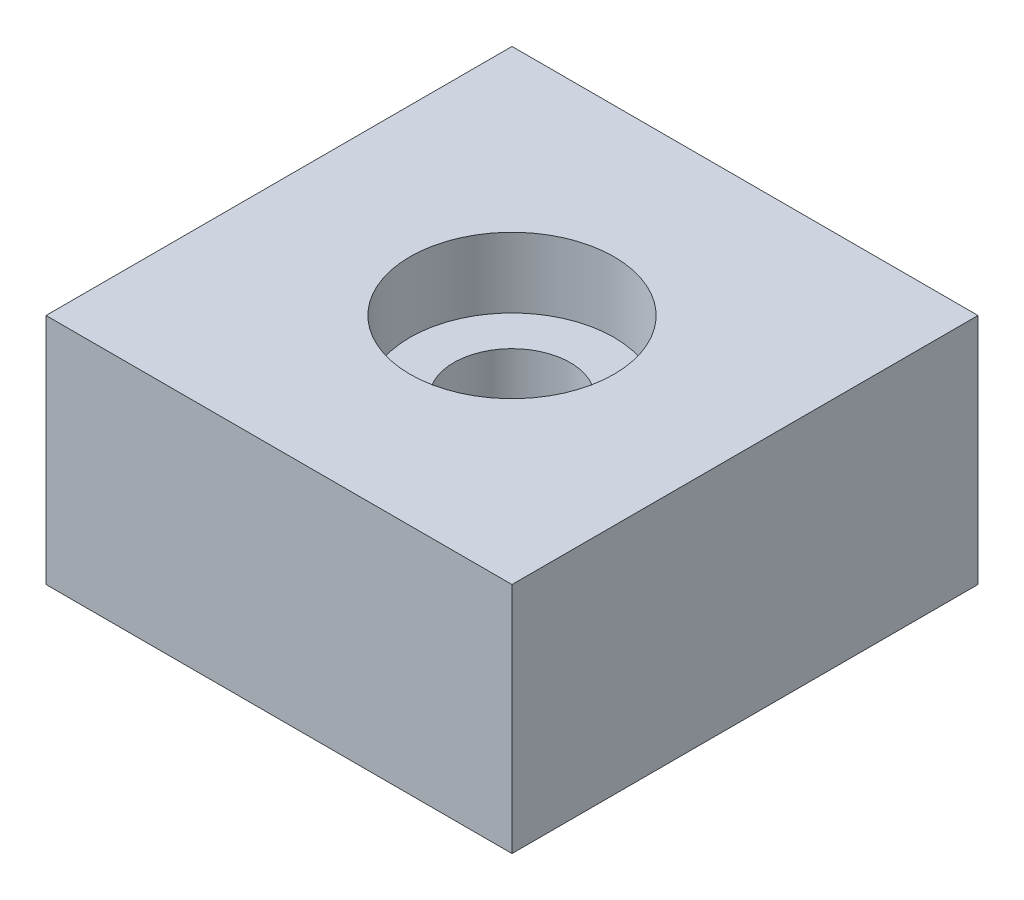
ISO-10303-21;
HEADER;
FILE_DESCRIPTION(('STEP AP214'),'2;1');
FILE_NAME('part.step','',(''),(''),'','','');
FILE_SCHEMA(('AUTOMOTIVE_DESIGN { 1 0 10303 214 1 1 1 1 }'));
ENDSEC;
DATA;
#1=APPLICATION_CONTEXT('core data for automotive mechanical design processes');
#2=APPLICATION_PROTOCOL_DEFINITION('international standard','automotive_design',2000,#1);
#3=PRODUCT_CONTEXT('',#1,'mechanical');
#4=PRODUCT('Part','Part','',(#3));
#5=PRODUCT_RELATED_PRODUCT_CATEGORY('part','',(#4));
#6=PRODUCT_DEFINITION_FORMATION('','',#4);
#7=PRODUCT_DEFINITION_CONTEXT('part definition',#1,'design');
#8=PRODUCT_DEFINITION('design','',#6,#7);
#9=PRODUCT_DEFINITION_SHAPE('','',#8);
#10=(LENGTH_UNIT() NAMED_UNIT(*) SI_UNIT(.MILLI.,.METRE.));
#11=(NAMED_UNIT(*) PLANE_ANGLE_UNIT() SI_UNIT($,.RADIAN.));
#12=(NAMED_UNIT(*) SI_UNIT($,.STERADIAN.) SOLID_ANGLE_UNIT());
#13=UNCERTAINTY_MEASURE_WITH_UNIT(LENGTH_MEASURE(1.E-05),#10,'distance_accuracy_value','');
#14=(GEOMETRIC_REPRESENTATION_CONTEXT(3) GLOBAL_UNCERTAINTY_ASSIGNED_CONTEXT((#13)) GLOBAL_UNIT_ASSIGNED_CONTEXT((#10,
#11,#12)) REPRESENTATION_CONTEXT('',''));
#15=CARTESIAN_POINT('',(0.,0.,0.));
#16=DIRECTION('',(0.,0.,1.));
#17=DIRECTION('',(1.,0.,0.));
#18=AXIS2_PLACEMENT_3D('',#15,#16,#17);
#19=CARTESIAN_POINT('',(25.4,25.4,25.4));
#20=DIRECTION('',(-1.,0.,0.));
#21=DIRECTION('',(0.,0.,1.));
#22=AXIS2_PLACEMENT_3D('',#19,#20,#21);
#23=PLANE('',#22);
#24=DIRECTION('',(0.,0.,-1.));
#25=VECTOR('',#24,1.);
#26=CARTESIAN_POINT('',(25.4,0.,25.4));
#27=LINE('',#26,#25);
#28=CARTESIAN_POINT('',(25.4,0.,25.4));
#29=VERTEX_POINT('',#28);
#30=CARTESIAN_POINT('',(25.4,0.,-25.4));
#31=VERTEX_POINT('',#30);
#32=EDGE_CURVE('E97',#29,#31,#27,.T.);
#33=ORIENTED_EDGE('',*,*,#32,.T.);
#34=DIRECTION('',(0.,-1.,0.));
#35=VECTOR('',#34,1.);
#36=CARTESIAN_POINT('',(25.4,25.4,-25.4));
#37=LINE('',#36,#35);
#38=CARTESIAN_POINT('',(25.4,25.4,-25.4));
#39=VERTEX_POINT('',#38);
#40=EDGE_CURVE('E11',#39,#31,#37,.T.);
#41=ORIENTED_EDGE('',*,*,#40,.F.);
#42=DIRECTION('',(0.,0.,-1.));
#43=VECTOR('',#42,1.);
#44=CARTESIAN_POINT('',(25.4,25.4,25.4));
#45=LINE('',#44,#43);
#46=CARTESIAN_POINT('',(25.4,25.4,25.4));
#47=VERTEX_POINT('',#46);
#48=EDGE_CURVE('E85',#47,#39,#45,.T.);
#49=ORIENTED_EDGE('',*,*,#48,.F.);
#50=DIRECTION('',(0.,-1.,0.));
#51=VECTOR('',#50,1.);
#52=CARTESIAN_POINT('',(25.4,25.4,25.4));
#53=LINE('',#52,#51);
#54=EDGE_CURVE('E93',#47,#29,#53,.T.);
#55=ORIENTED_EDGE('',*,*,#54,.T.);
#56=EDGE_LOOP('',(#33,#41,#49,#55));
#57=FACE_BOUND('',#56,.T.);
#58=ADVANCED_FACE('F34',(#57),#23,.F.);
#59=CARTESIAN_POINT('',(-25.4,25.4,-25.4));
#60=DIRECTION('',(0.,0.,1.));
#61=DIRECTION('',(1.,0.,0.));
#62=AXIS2_PLACEMENT_3D('',#59,#60,#61);
#63=PLANE('',#62);
#64=DIRECTION('',(-1.,0.,0.));
#65=VECTOR('',#64,1.);
#66=CARTESIAN_POINT('',(-25.4,0.,-25.4));
#67=LINE('',#66,#65);
#68=CARTESIAN_POINT('',(-25.4,0.,-25.4));
#69=VERTEX_POINT('',#68);
#70=EDGE_CURVE('E89',#31,#69,#67,.T.);
#71=ORIENTED_EDGE('',*,*,#70,.T.);
#72=DIRECTION('',(0.,-1.,0.));
#73=VECTOR('',#72,1.);
#74=CARTESIAN_POINT('',(-25.4,25.4,-25.4));
#75=LINE('',#74,#73);
#76=CARTESIAN_POINT('',(-25.4,25.4,-25.4));
#77=VERTEX_POINT('',#76);
#78=EDGE_CURVE('E42',#77,#69,#75,.T.);
#79=ORIENTED_EDGE('',*,*,#78,.F.);
#80=DIRECTION('',(-1.,0.,0.));
#81=VECTOR('',#80,1.);
#82=CARTESIAN_POINT('',(-25.4,25.4,-25.4));
#83=LINE('',#82,#81);
#84=EDGE_CURVE('E80',#39,#77,#83,.T.);
#85=ORIENTED_EDGE('',*,*,#84,.F.);
#86=ORIENTED_EDGE('',*,*,#40,.T.);
#87=EDGE_LOOP('',(#71,#79,#85,#86));
#88=FACE_BOUND('',#87,.T.);
#89=ADVANCED_FACE('F88',(#88),#63,.F.);
#90=CARTESIAN_POINT('',(-25.4,25.4,25.4));
#91=DIRECTION('',(1.,0.,0.));
#92=DIRECTION('',(0.,0.,-1.));
#93=AXIS2_PLACEMENT_3D('',#90,#91,#92);
#94=PLANE('',#93);
#95=DIRECTION('',(0.,0.,1.));
#96=VECTOR('',#95,1.);
#97=CARTESIAN_POINT('',(-25.4,0.,25.4));
#98=LINE('',#97,#96);
#99=CARTESIAN_POINT('',(-25.4,0.,25.4));
#100=VERTEX_POINT('',#99);
#101=EDGE_CURVE('E67',#69,#100,#98,.T.);
#102=ORIENTED_EDGE('',*,*,#101,.T.);
#103=DIRECTION('',(0.,-1.,0.));
#104=VECTOR('',#103,1.);
#105=CARTESIAN_POINT('',(-25.4,25.4,25.4));
#106=LINE('',#105,#104);
#107=CARTESIAN_POINT('',(-25.4,25.4,25.4));
#108=VERTEX_POINT('',#107);
#109=EDGE_CURVE('E90',#108,#100,#106,.T.);
#110=ORIENTED_EDGE('',*,*,#109,.F.);
#111=DIRECTION('',(0.,0.,1.));
#112=VECTOR('',#111,1.);
#113=CARTESIAN_POINT('',(-25.4,25.4,25.4));
#114=LINE('',#113,#112);
#115=EDGE_CURVE('E83',#77,#108,#114,.T.);
#116=ORIENTED_EDGE('',*,*,#115,.F.);
#117=ORIENTED_EDGE('',*,*,#78,.T.);
#118=EDGE_LOOP('',(#102,#110,#116,#117));
#119=FACE_BOUND('',#118,.T.);
#120=ADVANCED_FACE('F91',(#119),#94,.F.);
#121=CARTESIAN_POINT('',(-25.4,25.4,25.4));
#122=DIRECTION('',(0.,0.,-1.));
#123=DIRECTION('',(-1.,0.,0.));
#124=AXIS2_PLACEMENT_3D('',#121,#122,#123);
#125=PLANE('',#124);
#126=DIRECTION('',(1.,0.,0.));
#127=VECTOR('',#126,1.);
#128=CARTESIAN_POINT('',(-25.4,0.,25.4));
#129=LINE('',#128,#127);
#130=EDGE_CURVE('E73',#100,#29,#129,.T.);
#131=ORIENTED_EDGE('',*,*,#130,.T.);
#132=ORIENTED_EDGE('',*,*,#54,.F.);
#133=DIRECTION('',(1.,0.,0.));
#134=VECTOR('',#133,1.);
#135=CARTESIAN_POINT('',(-25.4,25.4,25.4));
#136=LINE('',#135,#134);
#137=EDGE_CURVE('E50',#108,#47,#136,.T.);
#138=ORIENTED_EDGE('',*,*,#137,.F.);
#139=ORIENTED_EDGE('',*,*,#109,.T.);
#140=EDGE_LOOP('',(#131,#132,#138,#139));
#141=FACE_BOUND('',#140,.T.);
#142=ADVANCED_FACE('F105',(#141),#125,.F.);
#143=CARTESIAN_POINT('',(0.,25.4,0.));
#144=DIRECTION('',(0.,-1.,0.));
#145=DIRECTION('',(0.,0.,-1.));
#146=AXIS2_PLACEMENT_3D('',#143,#144,#145);
#147=PLANE('',#146);
#148=CARTESIAN_POINT('',(0.,25.4,0.));
#149=DIRECTION('',(0.,1.,0.));
#150=DIRECTION('',(0.,0.,1.));
#151=AXIS2_PLACEMENT_3D('',#148,#149,#150);
#152=CIRCLE('',#151,11.1125);
#153=CARTESIAN_POINT('',(0.,25.4,11.1125));
#154=VERTEX_POINT('',#153);
#155=EDGE_CURVE('E119',#154,#154,#152,.T.);
#156=ORIENTED_EDGE('',*,*,#155,.F.);
#157=EDGE_LOOP('',(#156));
#158=FACE_BOUND('',#157,.T.);
#159=ORIENTED_EDGE('',*,*,#48,.T.);
#160=ORIENTED_EDGE('',*,*,#84,.T.);
#161=ORIENTED_EDGE('',*,*,#115,.T.);
#162=ORIENTED_EDGE('',*,*,#137,.T.);
#163=EDGE_LOOP('',(#159,#160,#161,#162));
#164=FACE_BOUND('',#163,.T.);
#165=ADVANCED_FACE('F81',(#158,#164),#147,.F.);
#166=CARTESIAN_POINT('',(0.,0.,0.));
#167=DIRECTION('',(0.,-1.,0.));
#168=DIRECTION('',(0.,0.,-1.));
#169=AXIS2_PLACEMENT_3D('',#166,#167,#168);
#170=PLANE('',#169);
#171=CARTESIAN_POINT('',(0.,0.,0.));
#172=DIRECTION('',(0.,1.,0.));
#173=DIRECTION('',(0.,0.,1.));
#174=AXIS2_PLACEMENT_3D('',#171,#172,#173);
#175=CIRCLE('',#174,6.34999999999999);
#176=CARTESIAN_POINT('',(0.,0.,6.34999999999999));
#177=VERTEX_POINT('',#176);
#178=EDGE_CURVE('E100',#177,#177,#175,.T.);
#179=ORIENTED_EDGE('',*,*,#178,.T.);
#180=EDGE_LOOP('',(#179));
#181=FACE_BOUND('',#180,.T.);
#182=ORIENTED_EDGE('',*,*,#32,.F.);
#183=ORIENTED_EDGE('',*,*,#130,.F.);
#184=ORIENTED_EDGE('',*,*,#101,.F.);
#185=ORIENTED_EDGE('',*,*,#70,.F.);
#186=EDGE_LOOP('',(#182,#183,#184,#185));
#187=FACE_BOUND('',#186,.T.);
#188=ADVANCED_FACE('F108',(#181,#187),#170,.T.);
#189=CARTESIAN_POINT('',(0.,25.4,0.));
#190=DIRECTION('',(0.,1.,0.));
#191=DIRECTION('',(0.,0.,1.));
#192=AXIS2_PLACEMENT_3D('',#189,#190,#191);
#193=CYLINDRICAL_SURFACE('',#192,6.34999999999999);
#194=ORIENTED_EDGE('',*,*,#178,.F.);
#195=EDGE_LOOP('',(#194));
#196=FACE_BOUND('',#195,.T.);
#197=CARTESIAN_POINT('',(0.,17.78,0.));
#198=DIRECTION('',(0.,1.,0.));
#199=DIRECTION('',(0.,0.,1.));
#200=AXIS2_PLACEMENT_3D('',#197,#198,#199);
#201=CIRCLE('',#200,6.35);
#202=CARTESIAN_POINT('',(0.,17.78,6.35));
#203=VERTEX_POINT('',#202);
#204=EDGE_CURVE('E113',#203,#203,#201,.T.);
#205=ORIENTED_EDGE('',*,*,#204,.T.);
#206=EDGE_LOOP('',(#205));
#207=FACE_BOUND('',#206,.T.);
#208=ADVANCED_FACE('F131',(#196,#207),#193,.F.);
#209=CARTESIAN_POINT('',(6.35,17.78,0.));
#210=DIRECTION('',(0.,-1.,0.));
#211=DIRECTION('',(0.,0.,-1.));
#212=AXIS2_PLACEMENT_3D('',#209,#210,#211);
#213=PLANE('',#212);
#214=ORIENTED_EDGE('',*,*,#204,.F.);
#215=EDGE_LOOP('',(#214));
#216=FACE_BOUND('',#215,.T.);
#217=CARTESIAN_POINT('',(0.,17.78,0.));
#218=DIRECTION('',(0.,1.,0.));
#219=DIRECTION('',(0.,0.,1.));
#220=AXIS2_PLACEMENT_3D('',#217,#218,#219);
#221=CIRCLE('',#220,11.1125);
#222=CARTESIAN_POINT('',(0.,17.78,11.1125));
#223=VERTEX_POINT('',#222);
#224=EDGE_CURVE('E116',#223,#223,#221,.T.);
#225=ORIENTED_EDGE('',*,*,#224,.T.);
#226=EDGE_LOOP('',(#225));
#227=FACE_BOUND('',#226,.T.);
#228=ADVANCED_FACE('F169',(#216,#227),#213,.F.);
#229=CARTESIAN_POINT('',(0.,25.4,0.));
#230=DIRECTION('',(0.,1.,0.));
#231=DIRECTION('',(0.,0.,1.));
#232=AXIS2_PLACEMENT_3D('',#229,#230,#231);
#233=CYLINDRICAL_SURFACE('',#232,11.1125);
#234=ORIENTED_EDGE('',*,*,#224,.F.);
#235=EDGE_LOOP('',(#234));
#236=FACE_BOUND('',#235,.T.);
#237=ORIENTED_EDGE('',*,*,#155,.T.);
#238=EDGE_LOOP('',(#237));
#239=FACE_BOUND('',#238,.T.);
#240=ADVANCED_FACE('F123',(#236,#239),#233,.F.);
#241=CLOSED_SHELL('',(#58,#89,#120,#142,#165,#188,#208,#228,#240));
#242=MANIFOLD_SOLID_BREP('B2',#241);
#243=ADVANCED_BREP_SHAPE_REPRESENTATION('',(#18,#242),#14);
#244=SHAPE_DEFINITION_REPRESENTATION(#9,#243);
ENDSEC;
END-ISO-10303-21;
